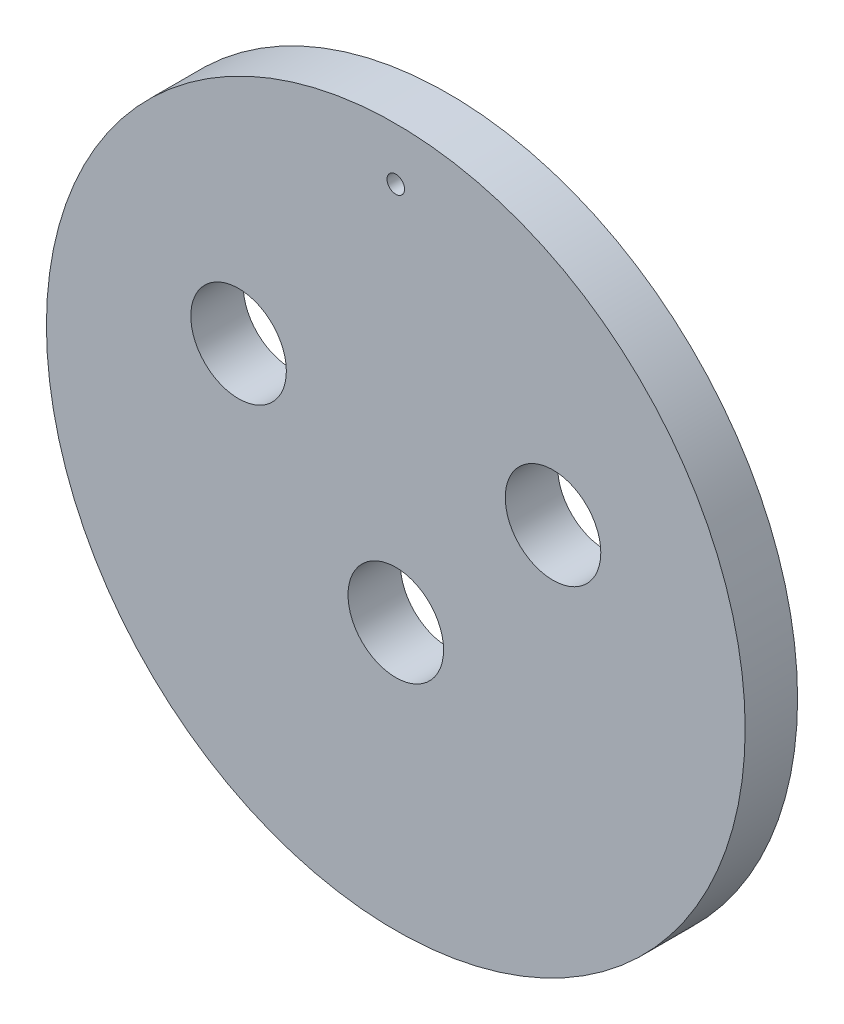
ISO-10303-21;
HEADER;
FILE_DESCRIPTION(('STEP AP214'),'2;1');
FILE_NAME('part.step','',(''),(''),'','','');
FILE_SCHEMA(('AUTOMOTIVE_DESIGN { 1 0 10303 214 1 1 1 1 }'));
ENDSEC;
DATA;
#1=APPLICATION_CONTEXT('core data for automotive mechanical design processes');
#2=APPLICATION_PROTOCOL_DEFINITION('international standard','automotive_design',2000,#1);
#3=PRODUCT_CONTEXT('',#1,'mechanical');
#4=PRODUCT('Part','Part','',(#3));
#5=PRODUCT_RELATED_PRODUCT_CATEGORY('part','',(#4));
#6=PRODUCT_DEFINITION_FORMATION('','',#4);
#7=PRODUCT_DEFINITION_CONTEXT('part definition',#1,'design');
#8=PRODUCT_DEFINITION('design','',#6,#7);
#9=PRODUCT_DEFINITION_SHAPE('','',#8);
#10=(LENGTH_UNIT() NAMED_UNIT(*) SI_UNIT(.MILLI.,.METRE.));
#11=(NAMED_UNIT(*) PLANE_ANGLE_UNIT() SI_UNIT($,.RADIAN.));
#12=(NAMED_UNIT(*) SI_UNIT($,.STERADIAN.) SOLID_ANGLE_UNIT());
#13=UNCERTAINTY_MEASURE_WITH_UNIT(LENGTH_MEASURE(1.E-05),#10,'distance_accuracy_value','');
#14=(GEOMETRIC_REPRESENTATION_CONTEXT(3) GLOBAL_UNCERTAINTY_ASSIGNED_CONTEXT((#13)) GLOBAL_UNIT_ASSIGNED_CONTEXT((#10,
#11,#12)) REPRESENTATION_CONTEXT('',''));
#15=CARTESIAN_POINT('',(0.,0.,0.));
#16=DIRECTION('',(0.,0.,1.));
#17=DIRECTION('',(1.,0.,0.));
#18=AXIS2_PLACEMENT_3D('',#15,#16,#17);
#19=CARTESIAN_POINT('',(0.,0.,3.));
#20=DIRECTION('',(0.,0.,-1.));
#21=DIRECTION('',(-1.,0.,0.));
#22=AXIS2_PLACEMENT_3D('',#19,#20,#21);
#23=CYLINDRICAL_SURFACE('',#22,20.);
#24=CARTESIAN_POINT('',(0.,0.,3.));
#25=DIRECTION('',(0.,0.,1.));
#26=DIRECTION('',(1.,0.,0.));
#27=AXIS2_PLACEMENT_3D('',#24,#25,#26);
#28=CIRCLE('',#27,20.);
#29=CARTESIAN_POINT('',(20.,0.,3.));
#30=VERTEX_POINT('',#29);
#31=EDGE_CURVE('E10',#30,#30,#28,.T.);
#32=ORIENTED_EDGE('',*,*,#31,.F.);
#33=EDGE_LOOP('',(#32));
#34=FACE_BOUND('',#33,.T.);
#35=CARTESIAN_POINT('',(0.,0.,0.));
#36=DIRECTION('',(0.,0.,1.));
#37=DIRECTION('',(1.,0.,0.));
#38=AXIS2_PLACEMENT_3D('',#35,#36,#37);
#39=CIRCLE('',#38,20.);
#40=CARTESIAN_POINT('',(20.,0.,0.));
#41=VERTEX_POINT('',#40);
#42=EDGE_CURVE('E49',#41,#41,#39,.T.);
#43=ORIENTED_EDGE('',*,*,#42,.T.);
#44=EDGE_LOOP('',(#43));
#45=FACE_BOUND('',#44,.T.);
#46=ADVANCED_FACE('F41',(#34,#45),#23,.T.);
#47=CARTESIAN_POINT('',(0.,0.,3.));
#48=DIRECTION('',(0.,0.,1.));
#49=DIRECTION('',(1.,0.,0.));
#50=AXIS2_PLACEMENT_3D('',#47,#48,#49);
#51=PLANE('',#50);
#52=CARTESIAN_POINT('',(0.,17.,3.));
#53=DIRECTION('',(0.,0.,1.));
#54=DIRECTION('',(1.,0.,0.));
#55=AXIS2_PLACEMENT_3D('',#52,#53,#54);
#56=CIRCLE('',#55,0.5);
#57=CARTESIAN_POINT('',(0.5,17.,3.));
#58=VERTEX_POINT('',#57);
#59=EDGE_CURVE('E114',#58,#58,#56,.T.);
#60=ORIENTED_EDGE('',*,*,#59,.F.);
#61=EDGE_LOOP('',(#60));
#62=FACE_BOUND('',#61,.T.);
#63=CARTESIAN_POINT('',(-9.,4.6,3.));
#64=DIRECTION('',(0.,0.,1.));
#65=DIRECTION('',(1.,0.,0.));
#66=AXIS2_PLACEMENT_3D('',#63,#64,#65);
#67=CIRCLE('',#66,2.735);
#68=CARTESIAN_POINT('',(-6.265,4.6,3.));
#69=VERTEX_POINT('',#68);
#70=EDGE_CURVE('E66',#69,#69,#67,.T.);
#71=ORIENTED_EDGE('',*,*,#70,.F.);
#72=EDGE_LOOP('',(#71));
#73=FACE_BOUND('',#72,.T.);
#74=CARTESIAN_POINT('',(9.,4.6,3.));
#75=DIRECTION('',(0.,0.,1.));
#76=DIRECTION('',(1.,0.,0.));
#77=AXIS2_PLACEMENT_3D('',#74,#75,#76);
#78=CIRCLE('',#77,2.735);
#79=CARTESIAN_POINT('',(11.735,4.6,3.));
#80=VERTEX_POINT('',#79);
#81=EDGE_CURVE('E118',#80,#80,#78,.T.);
#82=ORIENTED_EDGE('',*,*,#81,.F.);
#83=EDGE_LOOP('',(#82));
#84=FACE_BOUND('',#83,.T.);
#85=CARTESIAN_POINT('',(0.,-4.72365473771942,3.));
#86=DIRECTION('',(0.,0.,1.));
#87=DIRECTION('',(1.,0.,0.));
#88=AXIS2_PLACEMENT_3D('',#85,#86,#87);
#89=CIRCLE('',#88,2.735);
#90=CARTESIAN_POINT('',(2.735,-4.72365473771942,3.));
#91=VERTEX_POINT('',#90);
#92=EDGE_CURVE('E58',#91,#91,#89,.T.);
#93=ORIENTED_EDGE('',*,*,#92,.F.);
#94=EDGE_LOOP('',(#93));
#95=FACE_BOUND('',#94,.T.);
#96=ORIENTED_EDGE('',*,*,#31,.T.);
#97=EDGE_LOOP('',(#96));
#98=FACE_BOUND('',#97,.T.);
#99=ADVANCED_FACE('F93',(#62,#73,#84,#95,#98),#51,.T.);
#100=CARTESIAN_POINT('',(0.,0.,0.));
#101=DIRECTION('',(0.,0.,1.));
#102=DIRECTION('',(1.,0.,0.));
#103=AXIS2_PLACEMENT_3D('',#100,#101,#102);
#104=PLANE('',#103);
#105=CARTESIAN_POINT('',(0.,17.,0.));
#106=DIRECTION('',(0.,0.,1.));
#107=DIRECTION('',(1.,0.,0.));
#108=AXIS2_PLACEMENT_3D('',#105,#106,#107);
#109=CIRCLE('',#108,0.5);
#110=CARTESIAN_POINT('',(0.5,17.,0.));
#111=VERTEX_POINT('',#110);
#112=EDGE_CURVE('E44',#111,#111,#109,.T.);
#113=ORIENTED_EDGE('',*,*,#112,.T.);
#114=EDGE_LOOP('',(#113));
#115=FACE_BOUND('',#114,.T.);
#116=CARTESIAN_POINT('',(-9.,4.6,0.));
#117=DIRECTION('',(0.,0.,1.));
#118=DIRECTION('',(1.,0.,0.));
#119=AXIS2_PLACEMENT_3D('',#116,#117,#118);
#120=CIRCLE('',#119,2.735);
#121=CARTESIAN_POINT('',(-6.265,4.6,0.));
#122=VERTEX_POINT('',#121);
#123=EDGE_CURVE('E55',#122,#122,#120,.T.);
#124=ORIENTED_EDGE('',*,*,#123,.T.);
#125=EDGE_LOOP('',(#124));
#126=FACE_BOUND('',#125,.T.);
#127=CARTESIAN_POINT('',(9.,4.6,0.));
#128=DIRECTION('',(0.,0.,1.));
#129=DIRECTION('',(1.,0.,0.));
#130=AXIS2_PLACEMENT_3D('',#127,#128,#129);
#131=CIRCLE('',#130,2.735);
#132=CARTESIAN_POINT('',(11.735,4.6,0.));
#133=VERTEX_POINT('',#132);
#134=EDGE_CURVE('E65',#133,#133,#131,.T.);
#135=ORIENTED_EDGE('',*,*,#134,.T.);
#136=EDGE_LOOP('',(#135));
#137=FACE_BOUND('',#136,.T.);
#138=CARTESIAN_POINT('',(0.,-4.72365473771942,0.));
#139=DIRECTION('',(0.,0.,1.));
#140=DIRECTION('',(1.,0.,0.));
#141=AXIS2_PLACEMENT_3D('',#138,#139,#140);
#142=CIRCLE('',#141,2.735);
#143=CARTESIAN_POINT('',(2.735,-4.72365473771942,0.));
#144=VERTEX_POINT('',#143);
#145=EDGE_CURVE('E61',#144,#144,#142,.T.);
#146=ORIENTED_EDGE('',*,*,#145,.T.);
#147=EDGE_LOOP('',(#146));
#148=FACE_BOUND('',#147,.T.);
#149=ORIENTED_EDGE('',*,*,#42,.F.);
#150=EDGE_LOOP('',(#149));
#151=FACE_BOUND('',#150,.T.);
#152=ADVANCED_FACE('F73',(#115,#126,#137,#148,#151),#104,.F.);
#153=CARTESIAN_POINT('',(0.,-4.72365473771942,-7.));
#154=DIRECTION('',(0.,0.,1.));
#155=DIRECTION('',(1.,0.,0.));
#156=AXIS2_PLACEMENT_3D('',#153,#154,#155);
#157=CYLINDRICAL_SURFACE('',#156,2.735);
#158=ORIENTED_EDGE('',*,*,#92,.T.);
#159=EDGE_LOOP('',(#158));
#160=FACE_BOUND('',#159,.T.);
#161=ORIENTED_EDGE('',*,*,#145,.F.);
#162=EDGE_LOOP('',(#161));
#163=FACE_BOUND('',#162,.T.);
#164=ADVANCED_FACE('F88',(#160,#163),#157,.F.);
#165=CARTESIAN_POINT('',(9.,4.6,-7.));
#166=DIRECTION('',(0.,0.,1.));
#167=DIRECTION('',(1.,0.,0.));
#168=AXIS2_PLACEMENT_3D('',#165,#166,#167);
#169=CYLINDRICAL_SURFACE('',#168,2.735);
#170=ORIENTED_EDGE('',*,*,#81,.T.);
#171=EDGE_LOOP('',(#170));
#172=FACE_BOUND('',#171,.T.);
#173=ORIENTED_EDGE('',*,*,#134,.F.);
#174=EDGE_LOOP('',(#173));
#175=FACE_BOUND('',#174,.T.);
#176=ADVANCED_FACE('F79',(#172,#175),#169,.F.);
#177=CARTESIAN_POINT('',(-9.,4.6,-7.));
#178=DIRECTION('',(0.,0.,1.));
#179=DIRECTION('',(1.,0.,0.));
#180=AXIS2_PLACEMENT_3D('',#177,#178,#179);
#181=CYLINDRICAL_SURFACE('',#180,2.735);
#182=ORIENTED_EDGE('',*,*,#70,.T.);
#183=EDGE_LOOP('',(#182));
#184=FACE_BOUND('',#183,.T.);
#185=ORIENTED_EDGE('',*,*,#123,.F.);
#186=EDGE_LOOP('',(#185));
#187=FACE_BOUND('',#186,.T.);
#188=ADVANCED_FACE('F76',(#184,#187),#181,.F.);
#189=CARTESIAN_POINT('',(0.,17.,-7.));
#190=DIRECTION('',(0.,0.,1.));
#191=DIRECTION('',(1.,0.,0.));
#192=AXIS2_PLACEMENT_3D('',#189,#190,#191);
#193=CYLINDRICAL_SURFACE('',#192,0.5);
#194=ORIENTED_EDGE('',*,*,#59,.T.);
#195=EDGE_LOOP('',(#194));
#196=FACE_BOUND('',#195,.T.);
#197=ORIENTED_EDGE('',*,*,#112,.F.);
#198=EDGE_LOOP('',(#197));
#199=FACE_BOUND('',#198,.T.);
#200=ADVANCED_FACE('F78',(#196,#199),#193,.F.);
#201=CLOSED_SHELL('',(#46,#99,#152,#164,#176,#188,#200));
#202=MANIFOLD_SOLID_BREP('B2',#201);
#203=ADVANCED_BREP_SHAPE_REPRESENTATION('',(#18,#202),#14);
#204=SHAPE_DEFINITION_REPRESENTATION(#9,#203);
ENDSEC;
END-ISO-10303-21;
